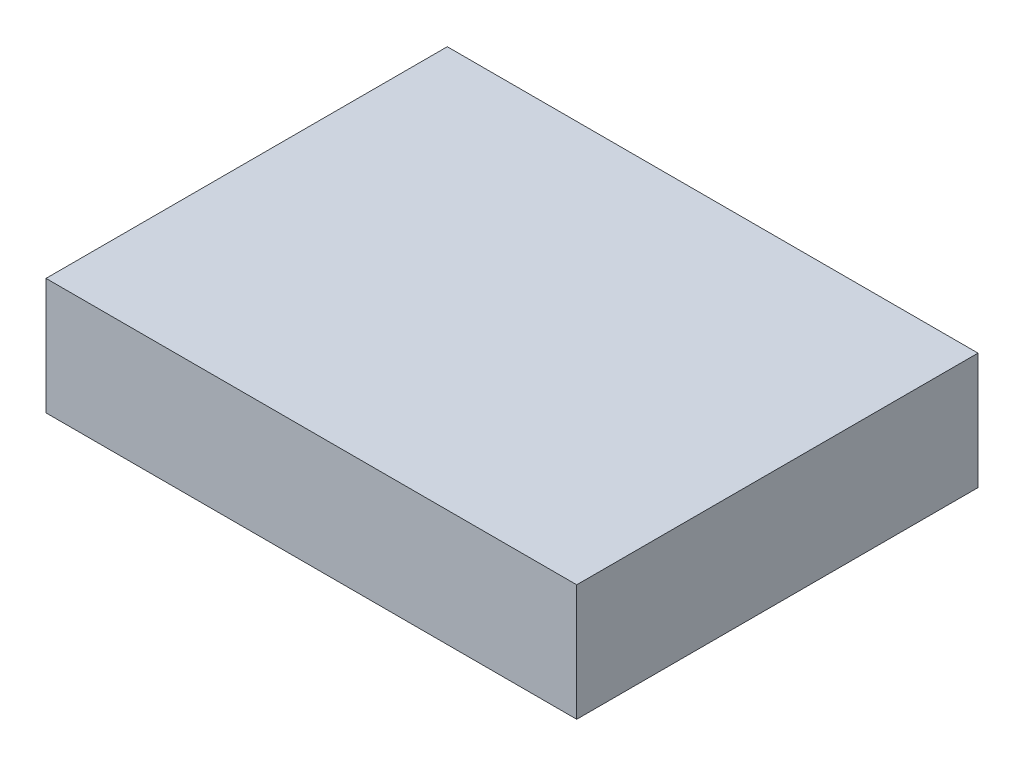
ISO-10303-21;
HEADER;
FILE_DESCRIPTION(('STEP AP214'),'2;1');
FILE_NAME('part.step','',(''),(''),'','','');
FILE_SCHEMA(('AUTOMOTIVE_DESIGN { 1 0 10303 214 1 1 1 1 }'));
ENDSEC;
DATA;
#1=APPLICATION_CONTEXT('core data for automotive mechanical design processes');
#2=APPLICATION_PROTOCOL_DEFINITION('international standard','automotive_design',2000,#1);
#3=PRODUCT_CONTEXT('',#1,'mechanical');
#4=PRODUCT('Part','Part','',(#3));
#5=PRODUCT_RELATED_PRODUCT_CATEGORY('part','',(#4));
#6=PRODUCT_DEFINITION_FORMATION('','',#4);
#7=PRODUCT_DEFINITION_CONTEXT('part definition',#1,'design');
#8=PRODUCT_DEFINITION('design','',#6,#7);
#9=PRODUCT_DEFINITION_SHAPE('','',#8);
#10=(LENGTH_UNIT() NAMED_UNIT(*) SI_UNIT(.MILLI.,.METRE.));
#11=(NAMED_UNIT(*) PLANE_ANGLE_UNIT() SI_UNIT($,.RADIAN.));
#12=(NAMED_UNIT(*) SI_UNIT($,.STERADIAN.) SOLID_ANGLE_UNIT());
#13=UNCERTAINTY_MEASURE_WITH_UNIT(LENGTH_MEASURE(1.E-05),#10,'distance_accuracy_value','');
#14=(GEOMETRIC_REPRESENTATION_CONTEXT(3) GLOBAL_UNCERTAINTY_ASSIGNED_CONTEXT((#13)) GLOBAL_UNIT_ASSIGNED_CONTEXT((#10,
#11,#12)) REPRESENTATION_CONTEXT('',''));
#15=CARTESIAN_POINT('',(0.,0.,0.));
#16=DIRECTION('',(0.,0.,1.));
#17=DIRECTION('',(1.,0.,0.));
#18=AXIS2_PLACEMENT_3D('',#15,#16,#17);
#19=CARTESIAN_POINT('',(0.,9.,0.));
#20=DIRECTION('',(1.,0.,0.));
#21=DIRECTION('',(0.,0.,-1.));
#22=AXIS2_PLACEMENT_3D('',#19,#20,#21);
#23=PLANE('',#22);
#24=DIRECTION('',(0.,0.,1.));
#25=VECTOR('',#24,1.);
#26=CARTESIAN_POINT('',(0.,0.,0.));
#27=LINE('',#26,#25);
#28=CARTESIAN_POINT('',(0.,0.,-31.));
#29=VERTEX_POINT('',#28);
#30=CARTESIAN_POINT('',(0.,0.,0.));
#31=VERTEX_POINT('',#30);
#32=EDGE_CURVE('E96',#29,#31,#27,.T.);
#33=ORIENTED_EDGE('',*,*,#32,.T.);
#34=DIRECTION('',(0.,-1.,0.));
#35=VECTOR('',#34,1.);
#36=CARTESIAN_POINT('',(0.,9.,0.));
#37=LINE('',#36,#35);
#38=CARTESIAN_POINT('',(0.,9.,0.));
#39=VERTEX_POINT('',#38);
#40=EDGE_CURVE('E11',#39,#31,#37,.T.);
#41=ORIENTED_EDGE('',*,*,#40,.F.);
#42=DIRECTION('',(0.,0.,1.));
#43=VECTOR('',#42,1.);
#44=CARTESIAN_POINT('',(0.,9.,0.));
#45=LINE('',#44,#43);
#46=CARTESIAN_POINT('',(0.,9.,-31.));
#47=VERTEX_POINT('',#46);
#48=EDGE_CURVE('E84',#47,#39,#45,.T.);
#49=ORIENTED_EDGE('',*,*,#48,.F.);
#50=DIRECTION('',(0.,-1.,0.));
#51=VECTOR('',#50,1.);
#52=CARTESIAN_POINT('',(0.,9.,-31.));
#53=LINE('',#52,#51);
#54=EDGE_CURVE('E92',#47,#29,#53,.T.);
#55=ORIENTED_EDGE('',*,*,#54,.T.);
#56=EDGE_LOOP('',(#33,#41,#49,#55));
#57=FACE_BOUND('',#56,.T.);
#58=ADVANCED_FACE('F33',(#57),#23,.F.);
#59=CARTESIAN_POINT('',(0.,9.,0.));
#60=DIRECTION('',(0.,0.,-1.));
#61=DIRECTION('',(-1.,0.,0.));
#62=AXIS2_PLACEMENT_3D('',#59,#60,#61);
#63=PLANE('',#62);
#64=DIRECTION('',(1.,0.,0.));
#65=VECTOR('',#64,1.);
#66=CARTESIAN_POINT('',(0.,0.,0.));
#67=LINE('',#66,#65);
#68=CARTESIAN_POINT('',(41.,0.,0.));
#69=VERTEX_POINT('',#68);
#70=EDGE_CURVE('E88',#31,#69,#67,.T.);
#71=ORIENTED_EDGE('',*,*,#70,.T.);
#72=DIRECTION('',(0.,-1.,0.));
#73=VECTOR('',#72,1.);
#74=CARTESIAN_POINT('',(41.,9.,0.));
#75=LINE('',#74,#73);
#76=CARTESIAN_POINT('',(41.,9.,0.));
#77=VERTEX_POINT('',#76);
#78=EDGE_CURVE('E41',#77,#69,#75,.T.);
#79=ORIENTED_EDGE('',*,*,#78,.F.);
#80=DIRECTION('',(1.,0.,0.));
#81=VECTOR('',#80,1.);
#82=CARTESIAN_POINT('',(0.,9.,0.));
#83=LINE('',#82,#81);
#84=EDGE_CURVE('E79',#39,#77,#83,.T.);
#85=ORIENTED_EDGE('',*,*,#84,.F.);
#86=ORIENTED_EDGE('',*,*,#40,.T.);
#87=EDGE_LOOP('',(#71,#79,#85,#86));
#88=FACE_BOUND('',#87,.T.);
#89=ADVANCED_FACE('F87',(#88),#63,.F.);
#90=CARTESIAN_POINT('',(41.,9.,0.));
#91=DIRECTION('',(-1.,0.,0.));
#92=DIRECTION('',(0.,0.,1.));
#93=AXIS2_PLACEMENT_3D('',#90,#91,#92);
#94=PLANE('',#93);
#95=DIRECTION('',(0.,0.,-1.));
#96=VECTOR('',#95,1.);
#97=CARTESIAN_POINT('',(41.,0.,0.));
#98=LINE('',#97,#96);
#99=CARTESIAN_POINT('',(41.,0.,-31.));
#100=VERTEX_POINT('',#99);
#101=EDGE_CURVE('E66',#69,#100,#98,.T.);
#102=ORIENTED_EDGE('',*,*,#101,.T.);
#103=DIRECTION('',(0.,-1.,0.));
#104=VECTOR('',#103,1.);
#105=CARTESIAN_POINT('',(41.,9.,-31.));
#106=LINE('',#105,#104);
#107=CARTESIAN_POINT('',(41.,9.,-31.));
#108=VERTEX_POINT('',#107);
#109=EDGE_CURVE('E89',#108,#100,#106,.T.);
#110=ORIENTED_EDGE('',*,*,#109,.F.);
#111=DIRECTION('',(0.,0.,-1.));
#112=VECTOR('',#111,1.);
#113=CARTESIAN_POINT('',(41.,9.,0.));
#114=LINE('',#113,#112);
#115=EDGE_CURVE('E82',#77,#108,#114,.T.);
#116=ORIENTED_EDGE('',*,*,#115,.F.);
#117=ORIENTED_EDGE('',*,*,#78,.T.);
#118=EDGE_LOOP('',(#102,#110,#116,#117));
#119=FACE_BOUND('',#118,.T.);
#120=ADVANCED_FACE('F90',(#119),#94,.F.);
#121=CARTESIAN_POINT('',(0.,9.,-31.));
#122=DIRECTION('',(0.,0.,1.));
#123=DIRECTION('',(1.,0.,0.));
#124=AXIS2_PLACEMENT_3D('',#121,#122,#123);
#125=PLANE('',#124);
#126=DIRECTION('',(-1.,0.,0.));
#127=VECTOR('',#126,1.);
#128=CARTESIAN_POINT('',(0.,0.,-31.));
#129=LINE('',#128,#127);
#130=EDGE_CURVE('E72',#100,#29,#129,.T.);
#131=ORIENTED_EDGE('',*,*,#130,.T.);
#132=ORIENTED_EDGE('',*,*,#54,.F.);
#133=DIRECTION('',(-1.,0.,0.));
#134=VECTOR('',#133,1.);
#135=CARTESIAN_POINT('',(0.,9.,-31.));
#136=LINE('',#135,#134);
#137=EDGE_CURVE('E49',#108,#47,#136,.T.);
#138=ORIENTED_EDGE('',*,*,#137,.F.);
#139=ORIENTED_EDGE('',*,*,#109,.T.);
#140=EDGE_LOOP('',(#131,#132,#138,#139));
#141=FACE_BOUND('',#140,.T.);
#142=ADVANCED_FACE('F103',(#141),#125,.F.);
#143=CARTESIAN_POINT('',(0.,9.,0.));
#144=DIRECTION('',(0.,-1.,0.));
#145=DIRECTION('',(0.,0.,-1.));
#146=AXIS2_PLACEMENT_3D('',#143,#144,#145);
#147=PLANE('',#146);
#148=ORIENTED_EDGE('',*,*,#48,.T.);
#149=ORIENTED_EDGE('',*,*,#84,.T.);
#150=ORIENTED_EDGE('',*,*,#115,.T.);
#151=ORIENTED_EDGE('',*,*,#137,.T.);
#152=EDGE_LOOP('',(#148,#149,#150,#151));
#153=FACE_BOUND('',#152,.T.);
#154=ADVANCED_FACE('F80',(#153),#147,.F.);
#155=CARTESIAN_POINT('',(0.,0.,0.));
#156=DIRECTION('',(0.,-1.,0.));
#157=DIRECTION('',(0.,0.,-1.));
#158=AXIS2_PLACEMENT_3D('',#155,#156,#157);
#159=PLANE('',#158);
#160=ORIENTED_EDGE('',*,*,#32,.F.);
#161=ORIENTED_EDGE('',*,*,#130,.F.);
#162=ORIENTED_EDGE('',*,*,#101,.F.);
#163=ORIENTED_EDGE('',*,*,#70,.F.);
#164=EDGE_LOOP('',(#160,#161,#162,#163));
#165=FACE_BOUND('',#164,.T.);
#166=ADVANCED_FACE('F106',(#165),#159,.T.);
#167=CLOSED_SHELL('',(#58,#89,#120,#142,#154,#166));
#168=MANIFOLD_SOLID_BREP('B2',#167);
#169=ADVANCED_BREP_SHAPE_REPRESENTATION('',(#18,#168),#14);
#170=SHAPE_DEFINITION_REPRESENTATION(#9,#169);
ENDSEC;
END-ISO-10303-21;
